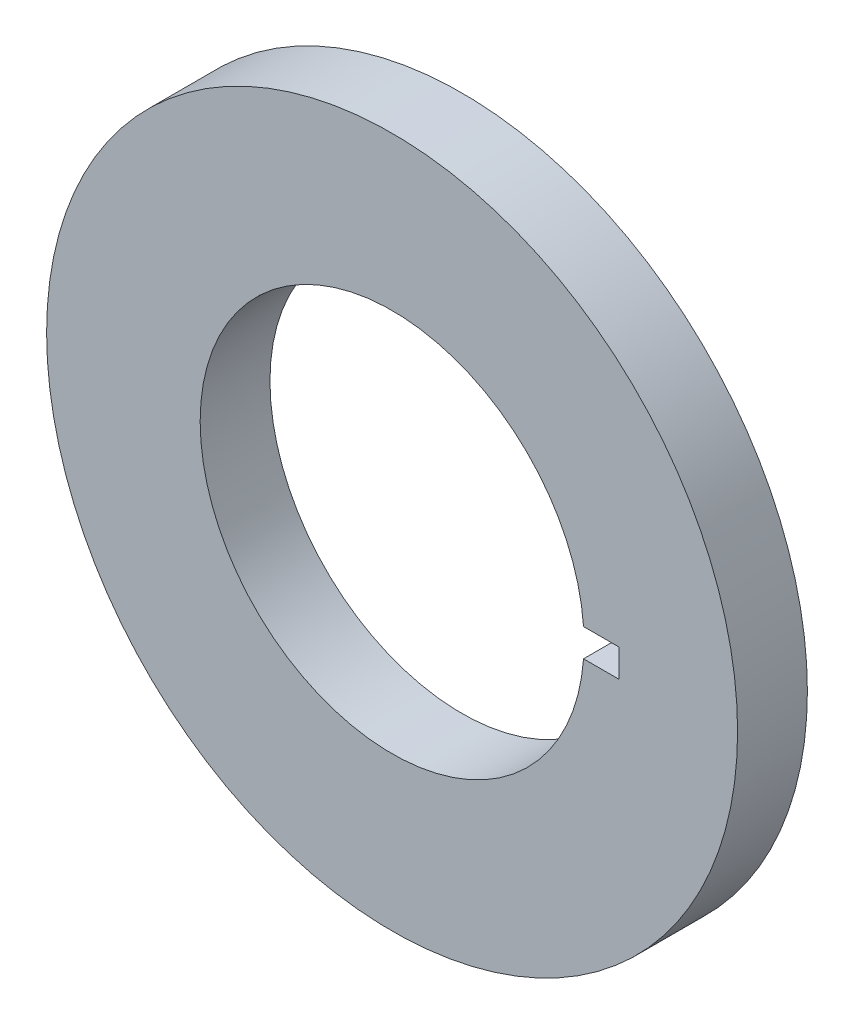
ISO-10303-21;
HEADER;
FILE_DESCRIPTION(('STEP AP214'),'2;1');
FILE_NAME('part.step','',(''),(''),'','','');
FILE_SCHEMA(('AUTOMOTIVE_DESIGN { 1 0 10303 214 1 1 1 1 }'));
ENDSEC;
DATA;
#1=APPLICATION_CONTEXT('core data for automotive mechanical design processes');
#2=APPLICATION_PROTOCOL_DEFINITION('international standard','automotive_design',2000,#1);
#3=PRODUCT_CONTEXT('',#1,'mechanical');
#4=PRODUCT('Part','Part','',(#3));
#5=PRODUCT_RELATED_PRODUCT_CATEGORY('part','',(#4));
#6=PRODUCT_DEFINITION_FORMATION('','',#4);
#7=PRODUCT_DEFINITION_CONTEXT('part definition',#1,'design');
#8=PRODUCT_DEFINITION('design','',#6,#7);
#9=PRODUCT_DEFINITION_SHAPE('','',#8);
#10=(LENGTH_UNIT() NAMED_UNIT(*) SI_UNIT(.MILLI.,.METRE.));
#11=(NAMED_UNIT(*) PLANE_ANGLE_UNIT() SI_UNIT($,.RADIAN.));
#12=(NAMED_UNIT(*) SI_UNIT($,.STERADIAN.) SOLID_ANGLE_UNIT());
#13=UNCERTAINTY_MEASURE_WITH_UNIT(LENGTH_MEASURE(1.E-05),#10,'distance_accuracy_value','');
#14=(GEOMETRIC_REPRESENTATION_CONTEXT(3) GLOBAL_UNCERTAINTY_ASSIGNED_CONTEXT((#13)) GLOBAL_UNIT_ASSIGNED_CONTEXT((#10,
#11,#12)) REPRESENTATION_CONTEXT('',''));
#15=CARTESIAN_POINT('',(0.,0.,0.));
#16=DIRECTION('',(0.,0.,1.));
#17=DIRECTION('',(1.,0.,0.));
#18=AXIS2_PLACEMENT_3D('',#15,#16,#17);
#19=CARTESIAN_POINT('',(0.,0.,10.));
#20=DIRECTION('',(0.,0.,1.));
#21=DIRECTION('',(1.,0.,0.));
#22=AXIS2_PLACEMENT_3D('',#19,#20,#21);
#23=PLANE('',#22);
#24=DIRECTION('',(1.,0.,0.));
#25=VECTOR('',#24,1.);
#26=CARTESIAN_POINT('',(22.5,-2.,10.));
#27=LINE('',#26,#25);
#28=CARTESIAN_POINT('',(27.427176303805,-2.,10.));
#29=VERTEX_POINT('',#28);
#30=CARTESIAN_POINT('',(32.5,-2.,10.));
#31=VERTEX_POINT('',#30);
#32=EDGE_CURVE('E89',#29,#31,#27,.T.);
#33=ORIENTED_EDGE('',*,*,#32,.F.);
#34=CARTESIAN_POINT('',(0.,0.,10.));
#35=DIRECTION('',(0.,0.,1.));
#36=DIRECTION('',(1.,0.,0.));
#37=AXIS2_PLACEMENT_3D('',#34,#35,#36);
#38=CIRCLE('',#37,27.5);
#39=CARTESIAN_POINT('',(27.427176303805,2.,10.));
#40=VERTEX_POINT('',#39);
#41=EDGE_CURVE('E98',#40,#29,#38,.T.);
#42=ORIENTED_EDGE('',*,*,#41,.F.);
#43=DIRECTION('',(-1.,0.,0.));
#44=VECTOR('',#43,1.);
#45=CARTESIAN_POINT('',(22.5,2.,10.));
#46=LINE('',#45,#44);
#47=CARTESIAN_POINT('',(32.5,2.,10.));
#48=VERTEX_POINT('',#47);
#49=EDGE_CURVE('E48',#48,#40,#46,.T.);
#50=ORIENTED_EDGE('',*,*,#49,.F.);
#51=DIRECTION('',(0.,1.,0.));
#52=VECTOR('',#51,1.);
#53=CARTESIAN_POINT('',(32.5,2.,10.));
#54=LINE('',#53,#52);
#55=EDGE_CURVE('E78',#31,#48,#54,.T.);
#56=ORIENTED_EDGE('',*,*,#55,.F.);
#57=EDGE_LOOP('',(#33,#42,#50,#56));
#58=FACE_BOUND('',#57,.T.);
#59=CARTESIAN_POINT('',(0.,0.,10.));
#60=DIRECTION('',(0.,0.,1.));
#61=DIRECTION('',(1.,0.,0.));
#62=AXIS2_PLACEMENT_3D('',#59,#60,#61);
#63=CIRCLE('',#62,49.5);
#64=CARTESIAN_POINT('',(49.5,0.,10.));
#65=VERTEX_POINT('',#64);
#66=EDGE_CURVE('E103',#65,#65,#63,.T.);
#67=ORIENTED_EDGE('',*,*,#66,.T.);
#68=EDGE_LOOP('',(#67));
#69=FACE_BOUND('',#68,.T.);
#70=ADVANCED_FACE('F33',(#58,#69),#23,.T.);
#71=CARTESIAN_POINT('',(0.,0.,0.));
#72=DIRECTION('',(0.,0.,1.));
#73=DIRECTION('',(1.,0.,0.));
#74=AXIS2_PLACEMENT_3D('',#71,#72,#73);
#75=PLANE('',#74);
#76=CARTESIAN_POINT('',(0.,0.,0.));
#77=DIRECTION('',(0.,0.,1.));
#78=DIRECTION('',(1.,0.,0.));
#79=AXIS2_PLACEMENT_3D('',#76,#77,#78);
#80=CIRCLE('',#79,49.5);
#81=CARTESIAN_POINT('',(49.5,0.,0.));
#82=VERTEX_POINT('',#81);
#83=EDGE_CURVE('E101',#82,#82,#80,.T.);
#84=ORIENTED_EDGE('',*,*,#83,.F.);
#85=EDGE_LOOP('',(#84));
#86=FACE_BOUND('',#85,.T.);
#87=CARTESIAN_POINT('',(0.,0.,0.));
#88=DIRECTION('',(0.,0.,1.));
#89=DIRECTION('',(1.,0.,0.));
#90=AXIS2_PLACEMENT_3D('',#87,#88,#89);
#91=CIRCLE('',#90,27.5);
#92=CARTESIAN_POINT('',(27.427176303805,2.,0.));
#93=VERTEX_POINT('',#92);
#94=CARTESIAN_POINT('',(27.427176303805,-2.,0.));
#95=VERTEX_POINT('',#94);
#96=EDGE_CURVE('E96',#93,#95,#91,.T.);
#97=ORIENTED_EDGE('',*,*,#96,.T.);
#98=DIRECTION('',(1.,0.,0.));
#99=VECTOR('',#98,1.);
#100=CARTESIAN_POINT('',(22.5,-2.,0.));
#101=LINE('',#100,#99);
#102=CARTESIAN_POINT('',(32.5,-2.,0.));
#103=VERTEX_POINT('',#102);
#104=EDGE_CURVE('E80',#95,#103,#101,.T.);
#105=ORIENTED_EDGE('',*,*,#104,.T.);
#106=DIRECTION('',(0.,1.,0.));
#107=VECTOR('',#106,1.);
#108=CARTESIAN_POINT('',(32.5,2.,0.));
#109=LINE('',#108,#107);
#110=CARTESIAN_POINT('',(32.5,2.,0.));
#111=VERTEX_POINT('',#110);
#112=EDGE_CURVE('E75',#103,#111,#109,.T.);
#113=ORIENTED_EDGE('',*,*,#112,.T.);
#114=DIRECTION('',(-1.,0.,0.));
#115=VECTOR('',#114,1.);
#116=CARTESIAN_POINT('',(22.5,2.,0.));
#117=LINE('',#116,#115);
#118=EDGE_CURVE('E82',#111,#93,#117,.T.);
#119=ORIENTED_EDGE('',*,*,#118,.T.);
#120=EDGE_LOOP('',(#97,#105,#113,#119));
#121=FACE_BOUND('',#120,.T.);
#122=ADVANCED_FACE('F88',(#86,#121),#75,.F.);
#123=CARTESIAN_POINT('',(0.,0.,10.));
#124=DIRECTION('',(0.,0.,-1.));
#125=DIRECTION('',(-1.,0.,0.));
#126=AXIS2_PLACEMENT_3D('',#123,#124,#125);
#127=CYLINDRICAL_SURFACE('',#126,49.5);
#128=ORIENTED_EDGE('',*,*,#66,.F.);
#129=EDGE_LOOP('',(#128));
#130=FACE_BOUND('',#129,.T.);
#131=ORIENTED_EDGE('',*,*,#83,.T.);
#132=EDGE_LOOP('',(#131));
#133=FACE_BOUND('',#132,.T.);
#134=ADVANCED_FACE('F35',(#130,#133),#127,.T.);
#135=CARTESIAN_POINT('',(0.,0.,10.));
#136=DIRECTION('',(0.,0.,-1.));
#137=DIRECTION('',(-1.,0.,0.));
#138=AXIS2_PLACEMENT_3D('',#135,#136,#137);
#139=CYLINDRICAL_SURFACE('',#138,27.5);
#140=DIRECTION('',(0.,0.,-1.));
#141=VECTOR('',#140,1.);
#142=CARTESIAN_POINT('',(27.427176303805,-2.,10.));
#143=LINE('',#142,#141);
#144=EDGE_CURVE('E11',#95,#29,#143,.F.);
#145=ORIENTED_EDGE('',*,*,#144,.F.);
#146=ORIENTED_EDGE('',*,*,#96,.F.);
#147=DIRECTION('',(0.,0.,-1.));
#148=VECTOR('',#147,1.);
#149=CARTESIAN_POINT('',(27.427176303805,2.,10.));
#150=LINE('',#149,#148);
#151=EDGE_CURVE('E41',#40,#93,#150,.T.);
#152=ORIENTED_EDGE('',*,*,#151,.F.);
#153=ORIENTED_EDGE('',*,*,#41,.T.);
#154=EDGE_LOOP('',(#145,#146,#152,#153));
#155=FACE_BOUND('',#154,.T.);
#156=ADVANCED_FACE('F115',(#155),#139,.F.);
#157=CARTESIAN_POINT('',(32.5,2.,0.));
#158=DIRECTION('',(1.,0.,0.));
#159=DIRECTION('',(0.,0.,-1.));
#160=AXIS2_PLACEMENT_3D('',#157,#158,#159);
#161=PLANE('',#160);
#162=ORIENTED_EDGE('',*,*,#55,.T.);
#163=DIRECTION('',(0.,0.,1.));
#164=VECTOR('',#163,1.);
#165=CARTESIAN_POINT('',(32.5,2.,0.));
#166=LINE('',#165,#164);
#167=EDGE_CURVE('E71',#111,#48,#166,.T.);
#168=ORIENTED_EDGE('',*,*,#167,.F.);
#169=ORIENTED_EDGE('',*,*,#112,.F.);
#170=DIRECTION('',(0.,0.,1.));
#171=VECTOR('',#170,1.);
#172=CARTESIAN_POINT('',(32.5,-2.,0.));
#173=LINE('',#172,#171);
#174=EDGE_CURVE('E79',#103,#31,#173,.T.);
#175=ORIENTED_EDGE('',*,*,#174,.T.);
#176=EDGE_LOOP('',(#162,#168,#169,#175));
#177=FACE_BOUND('',#176,.T.);
#178=ADVANCED_FACE('F72',(#177),#161,.F.);
#179=CARTESIAN_POINT('',(22.5,-2.,0.));
#180=DIRECTION('',(0.,-1.,0.));
#181=DIRECTION('',(0.,0.,-1.));
#182=AXIS2_PLACEMENT_3D('',#179,#180,#181);
#183=PLANE('',#182);
#184=ORIENTED_EDGE('',*,*,#144,.T.);
#185=ORIENTED_EDGE('',*,*,#32,.T.);
#186=ORIENTED_EDGE('',*,*,#174,.F.);
#187=ORIENTED_EDGE('',*,*,#104,.F.);
#188=EDGE_LOOP('',(#184,#185,#186,#187));
#189=FACE_BOUND('',#188,.T.);
#190=ADVANCED_FACE('F125',(#189),#183,.F.);
#191=CARTESIAN_POINT('',(22.5,2.,0.));
#192=DIRECTION('',(0.,1.,0.));
#193=DIRECTION('',(0.,0.,1.));
#194=AXIS2_PLACEMENT_3D('',#191,#192,#193);
#195=PLANE('',#194);
#196=ORIENTED_EDGE('',*,*,#151,.T.);
#197=ORIENTED_EDGE('',*,*,#118,.F.);
#198=ORIENTED_EDGE('',*,*,#167,.T.);
#199=ORIENTED_EDGE('',*,*,#49,.T.);
#200=EDGE_LOOP('',(#196,#197,#198,#199));
#201=FACE_BOUND('',#200,.T.);
#202=ADVANCED_FACE('F83',(#201),#195,.F.);
#203=CLOSED_SHELL('',(#70,#122,#134,#156,#178,#190,#202));
#204=MANIFOLD_SOLID_BREP('B2',#203);
#205=ADVANCED_BREP_SHAPE_REPRESENTATION('',(#18,#204),#14);
#206=SHAPE_DEFINITION_REPRESENTATION(#9,#205);
ENDSEC;
END-ISO-10303-21;
